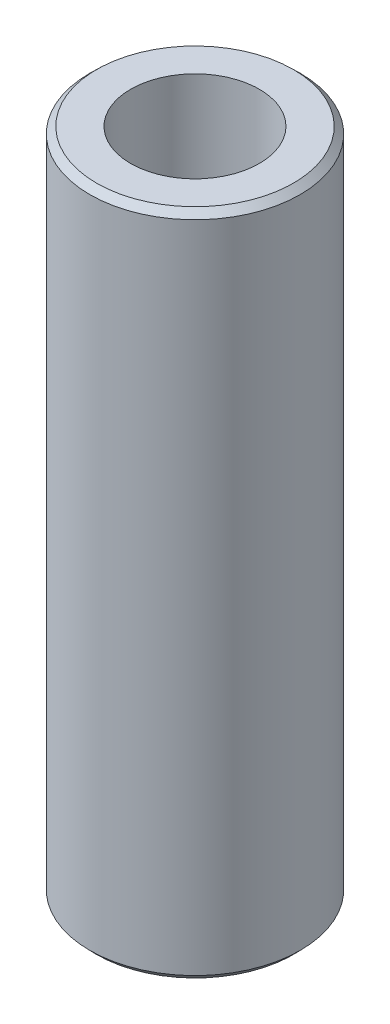
ISO-10303-21;
HEADER;
FILE_DESCRIPTION(('STEP AP214'),'2;1');
FILE_NAME('part.step','',(''),(''),'','','');
FILE_SCHEMA(('AUTOMOTIVE_DESIGN { 1 0 10303 214 1 1 1 1 }'));
ENDSEC;
DATA;
#1=APPLICATION_CONTEXT('core data for automotive mechanical design processes');
#2=APPLICATION_PROTOCOL_DEFINITION('international standard','automotive_design',2000,#1);
#3=PRODUCT_CONTEXT('',#1,'mechanical');
#4=PRODUCT('Part','Part','',(#3));
#5=PRODUCT_RELATED_PRODUCT_CATEGORY('part','',(#4));
#6=PRODUCT_DEFINITION_FORMATION('','',#4);
#7=PRODUCT_DEFINITION_CONTEXT('part definition',#1,'design');
#8=PRODUCT_DEFINITION('design','',#6,#7);
#9=PRODUCT_DEFINITION_SHAPE('','',#8);
#10=(LENGTH_UNIT() NAMED_UNIT(*) SI_UNIT(.MILLI.,.METRE.));
#11=(NAMED_UNIT(*) PLANE_ANGLE_UNIT() SI_UNIT($,.RADIAN.));
#12=(NAMED_UNIT(*) SI_UNIT($,.STERADIAN.) SOLID_ANGLE_UNIT());
#13=UNCERTAINTY_MEASURE_WITH_UNIT(LENGTH_MEASURE(1.E-05),#10,'distance_accuracy_value','');
#14=(GEOMETRIC_REPRESENTATION_CONTEXT(3) GLOBAL_UNCERTAINTY_ASSIGNED_CONTEXT((#13)) GLOBAL_UNIT_ASSIGNED_CONTEXT((#10,
#11,#12)) REPRESENTATION_CONTEXT('',''));
#15=CARTESIAN_POINT('',(0.,0.,0.));
#16=DIRECTION('',(0.,0.,1.));
#17=DIRECTION('',(1.,0.,0.));
#18=AXIS2_PLACEMENT_3D('',#15,#16,#17);
#19=CARTESIAN_POINT('',(0.,47.6238120102096,0.));
#20=DIRECTION('',(0.,-1.,0.));
#21=DIRECTION('',(0.,0.,-1.));
#22=AXIS2_PLACEMENT_3D('',#19,#20,#21);
#23=CYLINDRICAL_SURFACE('',#22,7.5);
#24=CARTESIAN_POINT('',(0.,47.1576658241169,0.));
#25=DIRECTION('',(0.,1.,0.));
#26=DIRECTION('',(0.,0.,1.));
#27=AXIS2_PLACEMENT_3D('',#24,#25,#26);
#28=CIRCLE('',#27,7.5);
#29=CARTESIAN_POINT('',(0.,47.1576658241169,7.5));
#30=VERTEX_POINT('',#29);
#31=EDGE_CURVE('E50',#30,#30,#28,.F.);
#32=ORIENTED_EDGE('',*,*,#31,.T.);
#33=EDGE_LOOP('',(#32));
#34=FACE_BOUND('',#33,.T.);
#35=CARTESIAN_POINT('',(0.,0.479885176968009,0.));
#36=DIRECTION('',(0.,1.,0.));
#37=DIRECTION('',(0.,0.,1.));
#38=AXIS2_PLACEMENT_3D('',#35,#36,#37);
#39=CIRCLE('',#38,7.5);
#40=CARTESIAN_POINT('',(0.,0.479885176968009,7.5));
#41=VERTEX_POINT('',#40);
#42=EDGE_CURVE('E51',#41,#41,#39,.T.);
#43=ORIENTED_EDGE('',*,*,#42,.T.);
#44=EDGE_LOOP('',(#43));
#45=FACE_BOUND('',#44,.T.);
#46=ADVANCED_FACE('F39',(#34,#45),#23,.T.);
#47=CARTESIAN_POINT('',(0.,47.6238120102096,0.));
#48=DIRECTION('',(0.,1.,0.));
#49=DIRECTION('',(0.,0.,1.));
#50=AXIS2_PLACEMENT_3D('',#47,#48,#49);
#51=PLANE('',#50);
#52=CARTESIAN_POINT('',(0.,47.6238120102096,0.));
#53=DIRECTION('',(0.,1.,0.));
#54=DIRECTION('',(0.,0.,1.));
#55=AXIS2_PLACEMENT_3D('',#52,#53,#54);
#56=CIRCLE('',#55,7.02011482303197);
#57=CARTESIAN_POINT('',(0.,47.6238120102096,7.02011482303197));
#58=VERTEX_POINT('',#57);
#59=EDGE_CURVE('E54',#58,#58,#56,.T.);
#60=ORIENTED_EDGE('',*,*,#59,.T.);
#61=EDGE_LOOP('',(#60));
#62=FACE_BOUND('',#61,.T.);
#63=CARTESIAN_POINT('',(0.,47.6238120102096,0.));
#64=DIRECTION('',(0.,1.,0.));
#65=DIRECTION('',(0.,0.,1.));
#66=AXIS2_PLACEMENT_3D('',#63,#64,#65);
#67=CIRCLE('',#66,4.58963231584794);
#68=CARTESIAN_POINT('',(0.,47.6238120102096,4.58963231584794));
#69=VERTEX_POINT('',#68);
#70=EDGE_CURVE('E58',#69,#69,#67,.T.);
#71=ORIENTED_EDGE('',*,*,#70,.F.);
#72=EDGE_LOOP('',(#71));
#73=FACE_BOUND('',#72,.T.);
#74=ADVANCED_FACE('F69',(#62,#73),#51,.T.);
#75=CARTESIAN_POINT('',(0.,0.,0.));
#76=DIRECTION('',(0.,1.,0.));
#77=DIRECTION('',(0.,0.,1.));
#78=AXIS2_PLACEMENT_3D('',#75,#76,#77);
#79=PLANE('',#78);
#80=CARTESIAN_POINT('',(0.,0.,0.));
#81=DIRECTION('',(0.,1.,0.));
#82=DIRECTION('',(0.,0.,1.));
#83=AXIS2_PLACEMENT_3D('',#80,#81,#82);
#84=CIRCLE('',#83,7.0338538139074);
#85=CARTESIAN_POINT('',(0.,0.,7.0338538139074));
#86=VERTEX_POINT('',#85);
#87=EDGE_CURVE('E10',#86,#86,#84,.F.);
#88=ORIENTED_EDGE('',*,*,#87,.T.);
#89=EDGE_LOOP('',(#88));
#90=FACE_BOUND('',#89,.T.);
#91=CARTESIAN_POINT('',(0.,0.,0.));
#92=DIRECTION('',(0.,1.,0.));
#93=DIRECTION('',(0.,0.,1.));
#94=AXIS2_PLACEMENT_3D('',#91,#92,#93);
#95=CIRCLE('',#94,4.58963231584794);
#96=CARTESIAN_POINT('',(0.,0.,4.58963231584794));
#97=VERTEX_POINT('',#96);
#98=EDGE_CURVE('E63',#97,#97,#95,.T.);
#99=ORIENTED_EDGE('',*,*,#98,.T.);
#100=EDGE_LOOP('',(#99));
#101=FACE_BOUND('',#100,.T.);
#102=ADVANCED_FACE('F75',(#90,#101),#79,.F.);
#103=CARTESIAN_POINT('',(0.,47.6238120102096,0.));
#104=DIRECTION('',(0.,-1.,0.));
#105=DIRECTION('',(0.,0.,-1.));
#106=AXIS2_PLACEMENT_3D('',#103,#104,#105);
#107=CYLINDRICAL_SURFACE('',#106,4.58963231584794);
#108=ORIENTED_EDGE('',*,*,#70,.T.);
#109=EDGE_LOOP('',(#108));
#110=FACE_BOUND('',#109,.T.);
#111=ORIENTED_EDGE('',*,*,#98,.F.);
#112=EDGE_LOOP('',(#111));
#113=FACE_BOUND('',#112,.T.);
#114=ADVANCED_FACE('F70',(#110,#113),#107,.F.);
#115=CARTESIAN_POINT('',(0.,47.6238120102096,0.));
#116=DIRECTION('',(0.,-1.,0.));
#117=DIRECTION('',(0.,0.,-1.));
#118=AXIS2_PLACEMENT_3D('',#115,#116,#117);
#119=CONICAL_SURFACE('',#118,7.02011482303197,0.79991990721485);
#120=ORIENTED_EDGE('',*,*,#31,.F.);
#121=EDGE_LOOP('',(#120));
#122=FACE_BOUND('',#121,.T.);
#123=ORIENTED_EDGE('',*,*,#59,.F.);
#124=EDGE_LOOP('',(#123));
#125=FACE_BOUND('',#124,.T.);
#126=ADVANCED_FACE('F81',(#122,#125),#119,.T.);
#127=CARTESIAN_POINT('',(0.,0.479885176968009,0.));
#128=DIRECTION('',(0.,1.,0.));
#129=DIRECTION('',(0.,0.,1.));
#130=AXIS2_PLACEMENT_3D('',#127,#128,#129);
#131=CONICAL_SURFACE('',#130,7.5,0.77087641958005);
#132=ORIENTED_EDGE('',*,*,#87,.F.);
#133=EDGE_LOOP('',(#132));
#134=FACE_BOUND('',#133,.T.);
#135=ORIENTED_EDGE('',*,*,#42,.F.);
#136=EDGE_LOOP('',(#135));
#137=FACE_BOUND('',#136,.T.);
#138=ADVANCED_FACE('F45',(#134,#137),#131,.T.);
#139=CLOSED_SHELL('',(#46,#74,#102,#114,#126,#138));
#140=MANIFOLD_SOLID_BREP('B2',#139);
#141=ADVANCED_BREP_SHAPE_REPRESENTATION('',(#18,#140),#14);
#142=SHAPE_DEFINITION_REPRESENTATION(#9,#141);
ENDSEC;
END-ISO-10303-21;
